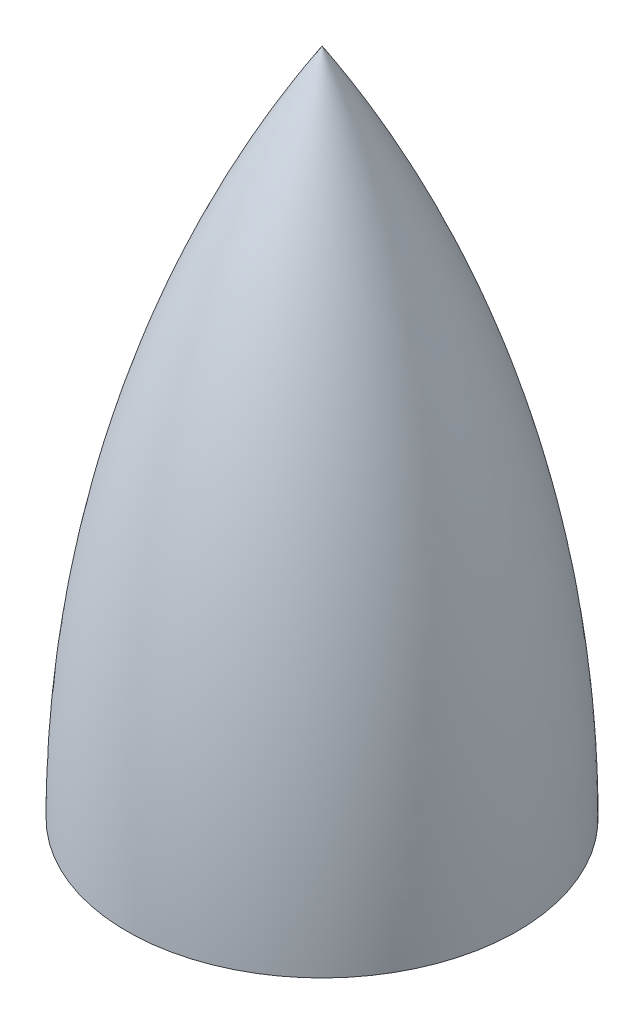
ISO-10303-21;
HEADER;
FILE_DESCRIPTION(('STEP AP214'),'2;1');
FILE_NAME('part.step','',(''),(''),'','','');
FILE_SCHEMA(('AUTOMOTIVE_DESIGN { 1 0 10303 214 1 1 1 1 }'));
ENDSEC;
DATA;
#1=APPLICATION_CONTEXT('core data for automotive mechanical design processes');
#2=APPLICATION_PROTOCOL_DEFINITION('international standard','automotive_design',2000,#1);
#3=PRODUCT_CONTEXT('',#1,'mechanical');
#4=PRODUCT('Part','Part','',(#3));
#5=PRODUCT_RELATED_PRODUCT_CATEGORY('part','',(#4));
#6=PRODUCT_DEFINITION_FORMATION('','',#4);
#7=PRODUCT_DEFINITION_CONTEXT('part definition',#1,'design');
#8=PRODUCT_DEFINITION('design','',#6,#7);
#9=PRODUCT_DEFINITION_SHAPE('','',#8);
#10=(LENGTH_UNIT() NAMED_UNIT(*) SI_UNIT(.MILLI.,.METRE.));
#11=(NAMED_UNIT(*) PLANE_ANGLE_UNIT() SI_UNIT($,.RADIAN.));
#12=(NAMED_UNIT(*) SI_UNIT($,.STERADIAN.) SOLID_ANGLE_UNIT());
#13=UNCERTAINTY_MEASURE_WITH_UNIT(LENGTH_MEASURE(1.E-05),#10,'distance_accuracy_value','');
#14=(GEOMETRIC_REPRESENTATION_CONTEXT(3) GLOBAL_UNCERTAINTY_ASSIGNED_CONTEXT((#13)) GLOBAL_UNIT_ASSIGNED_CONTEXT((#10,
#11,#12)) REPRESENTATION_CONTEXT('',''));
#15=CARTESIAN_POINT('',(0.,0.,0.));
#16=DIRECTION('',(0.,0.,1.));
#17=DIRECTION('',(1.,0.,0.));
#18=AXIS2_PLACEMENT_3D('',#15,#16,#17);
#19=CARTESIAN_POINT('',(0.,0.,0.));
#20=DIRECTION('',(0.,-1.,0.));
#21=DIRECTION('',(0.,0.,-1.));
#22=AXIS2_PLACEMENT_3D('',#19,#20,#21);
#23=PLANE('',#22);
#24=CARTESIAN_POINT('',(0.,0.,0.));
#25=DIRECTION('',(0.,-1.,0.));
#26=DIRECTION('',(0.,0.,-1.));
#27=AXIS2_PLACEMENT_3D('',#24,#25,#26);
#28=CIRCLE('',#27,3500.);
#29=CARTESIAN_POINT('',(0.,0.,-3500.));
#30=VERTEX_POINT('',#29);
#31=EDGE_CURVE('E11',#30,#30,#28,.T.);
#32=ORIENTED_EDGE('',*,*,#31,.T.);
#33=EDGE_LOOP('',(#32));
#34=FACE_BOUND('',#33,.T.);
#35=ADVANCED_FACE('F39',(#34),#23,.T.);
#36=CARTESIAN_POINT('',(0.,0.12500010208516,18820.99999965));
#37=DIRECTION('',(-1.,0.,0.));
#38=DIRECTION('',(0.,0.,-1.));
#39=AXIS2_PLACEMENT_3D('',#36,#37,#38);
#40=CIRCLE('',#39,22321.);
#41=TRIMMED_CURVE('',#40,(PARAMETER_VALUE(-0.567593818528751)),
(PARAMETER_VALUE(0.567593818528751)),.T.,.PARAMETER.);
#42=CARTESIAN_POINT('',(0.,0.12500010208516,0.));
#43=DIRECTION('',(0.,-1.,0.));
#44=AXIS1_PLACEMENT('',#42,#43);
#45=SURFACE_OF_REVOLUTION('',#41,#44);
#46=CARTESIAN_POINT('',(3.5527136788005E-12,12000.,0.));
#47=VERTEX_POINT('',#46);
#48=VERTEX_LOOP('',#47);
#49=FACE_BOUND('',#48,.T.);
#50=ORIENTED_EDGE('',*,*,#31,.F.);
#51=EDGE_LOOP('',(#50));
#52=FACE_BOUND('',#51,.T.);
#53=ADVANCED_FACE('F46',(#49,#52),#45,.T.);
#54=CLOSED_SHELL('',(#35,#53));
#55=MANIFOLD_SOLID_BREP('B2',#54);
#56=ADVANCED_BREP_SHAPE_REPRESENTATION('',(#18,#55),#14);
#57=SHAPE_DEFINITION_REPRESENTATION(#9,#56);
ENDSEC;
END-ISO-10303-21;
